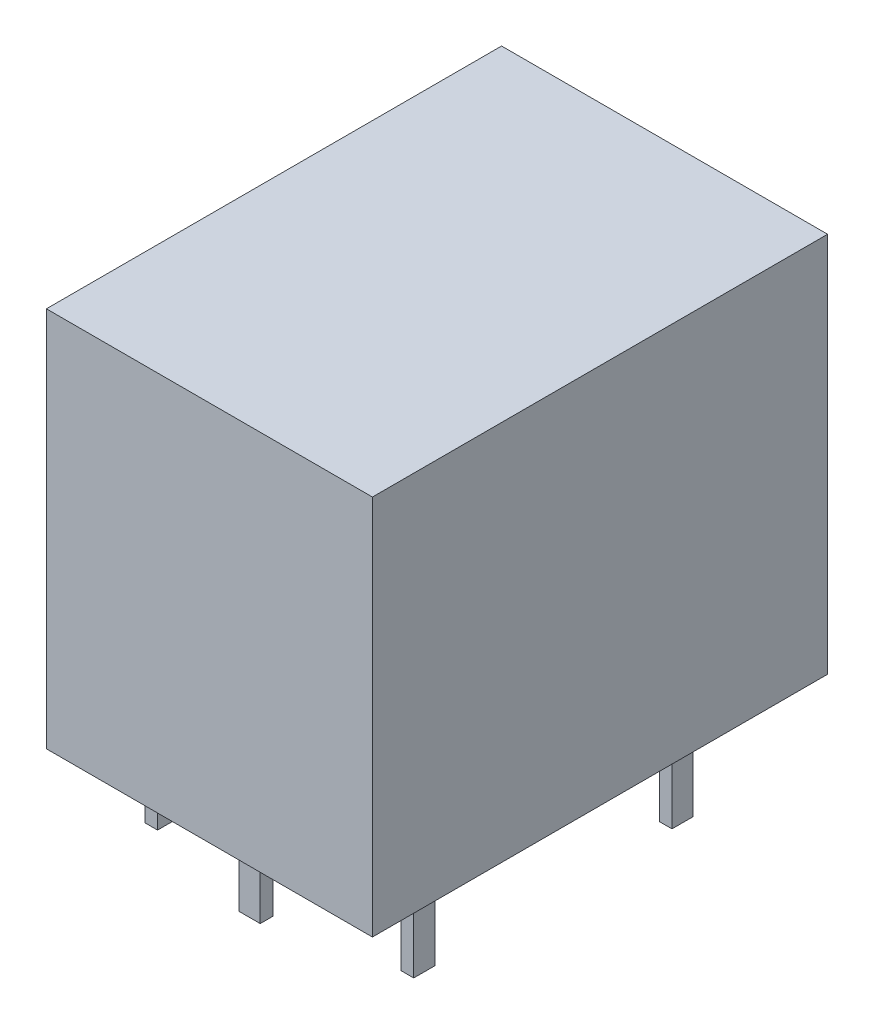
ISO-10303-21;
HEADER;
FILE_DESCRIPTION(('STEP AP214'),'2;1');
FILE_NAME('part.step','',(''),(''),'','','');
FILE_SCHEMA(('AUTOMOTIVE_DESIGN { 1 0 10303 214 1 1 1 1 }'));
ENDSEC;
DATA;
#1=APPLICATION_CONTEXT('core data for automotive mechanical design processes');
#2=APPLICATION_PROTOCOL_DEFINITION('international standard','automotive_design',2000,#1);
#3=PRODUCT_CONTEXT('',#1,'mechanical');
#4=PRODUCT('Part','Part','',(#3));
#5=PRODUCT_RELATED_PRODUCT_CATEGORY('part','',(#4));
#6=PRODUCT_DEFINITION_FORMATION('','',#4);
#7=PRODUCT_DEFINITION_CONTEXT('part definition',#1,'design');
#8=PRODUCT_DEFINITION('design','',#6,#7);
#9=PRODUCT_DEFINITION_SHAPE('','',#8);
#10=(LENGTH_UNIT() NAMED_UNIT(*) SI_UNIT(.MILLI.,.METRE.));
#11=(NAMED_UNIT(*) PLANE_ANGLE_UNIT() SI_UNIT($,.RADIAN.));
#12=(NAMED_UNIT(*) SI_UNIT($,.STERADIAN.) SOLID_ANGLE_UNIT());
#13=UNCERTAINTY_MEASURE_WITH_UNIT(LENGTH_MEASURE(1.E-05),#10,'distance_accuracy_value','');
#14=(GEOMETRIC_REPRESENTATION_CONTEXT(3) GLOBAL_UNCERTAINTY_ASSIGNED_CONTEXT((#13)) GLOBAL_UNIT_ASSIGNED_CONTEXT((#10,
#11,#12)) REPRESENTATION_CONTEXT('',''));
#15=CARTESIAN_POINT('',(0.,0.,0.));
#16=DIRECTION('',(0.,0.,1.));
#17=DIRECTION('',(1.,0.,0.));
#18=AXIS2_PLACEMENT_3D('',#15,#16,#17);
#19=CARTESIAN_POINT('',(5.75,-4.,-4.75));
#20=DIRECTION('',(1.,0.,0.));
#21=DIRECTION('',(0.,0.,-1.));
#22=AXIS2_PLACEMENT_3D('',#19,#20,#21);
#23=PLANE('',#22);
#24=DIRECTION('',(0.,0.,-1.));
#25=VECTOR('',#24,1.);
#26=CARTESIAN_POINT('',(5.75,0.,-4.75));
#27=LINE('',#26,#25);
#28=CARTESIAN_POINT('',(5.75,0.,-4.75));
#29=VERTEX_POINT('',#28);
#30=CARTESIAN_POINT('',(5.75,0.,-5.75));
#31=VERTEX_POINT('',#30);
#32=EDGE_CURVE('E109',#29,#31,#27,.T.);
#33=ORIENTED_EDGE('',*,*,#32,.T.);
#34=DIRECTION('',(0.,1.,0.));
#35=VECTOR('',#34,1.);
#36=CARTESIAN_POINT('',(5.75,-4.,-5.75));
#37=LINE('',#36,#35);
#38=CARTESIAN_POINT('',(5.75,-4.,-5.75));
#39=VERTEX_POINT('',#38);
#40=EDGE_CURVE('E12',#39,#31,#37,.T.);
#41=ORIENTED_EDGE('',*,*,#40,.F.);
#42=DIRECTION('',(0.,0.,-1.));
#43=VECTOR('',#42,1.);
#44=CARTESIAN_POINT('',(5.75,-4.,-4.75));
#45=LINE('',#44,#43);
#46=CARTESIAN_POINT('',(5.75,-4.,-4.75));
#47=VERTEX_POINT('',#46);
#48=EDGE_CURVE('E97',#47,#39,#45,.T.);
#49=ORIENTED_EDGE('',*,*,#48,.F.);
#50=DIRECTION('',(0.,1.,0.));
#51=VECTOR('',#50,1.);
#52=CARTESIAN_POINT('',(5.75,-4.,-4.75));
#53=LINE('',#52,#51);
#54=EDGE_CURVE('E105',#47,#29,#53,.T.);
#55=ORIENTED_EDGE('',*,*,#54,.T.);
#56=EDGE_LOOP('',(#33,#41,#49,#55));
#57=FACE_BOUND('',#56,.T.);
#58=ADVANCED_FACE('F46',(#57),#23,.F.);
#59=CARTESIAN_POINT('',(5.75,-4.,-5.75));
#60=DIRECTION('',(0.,0.,1.));
#61=DIRECTION('',(1.,0.,0.));
#62=AXIS2_PLACEMENT_3D('',#59,#60,#61);
#63=PLANE('',#62);
#64=DIRECTION('',(1.,0.,0.));
#65=VECTOR('',#64,1.);
#66=CARTESIAN_POINT('',(5.75,0.,-5.75));
#67=LINE('',#66,#65);
#68=CARTESIAN_POINT('',(6.35,0.,-5.75));
#69=VERTEX_POINT('',#68);
#70=EDGE_CURVE('E101',#31,#69,#67,.T.);
#71=ORIENTED_EDGE('',*,*,#70,.T.);
#72=DIRECTION('',(0.,1.,0.));
#73=VECTOR('',#72,1.);
#74=CARTESIAN_POINT('',(6.35,-4.,-5.75));
#75=LINE('',#74,#73);
#76=CARTESIAN_POINT('',(6.35,-4.,-5.75));
#77=VERTEX_POINT('',#76);
#78=EDGE_CURVE('E54',#77,#69,#75,.T.);
#79=ORIENTED_EDGE('',*,*,#78,.F.);
#80=DIRECTION('',(1.,0.,0.));
#81=VECTOR('',#80,1.);
#82=CARTESIAN_POINT('',(5.75,-4.,-5.75));
#83=LINE('',#82,#81);
#84=EDGE_CURVE('E92',#39,#77,#83,.T.);
#85=ORIENTED_EDGE('',*,*,#84,.F.);
#86=ORIENTED_EDGE('',*,*,#40,.T.);
#87=EDGE_LOOP('',(#71,#79,#85,#86));
#88=FACE_BOUND('',#87,.T.);
#89=ADVANCED_FACE('F100',(#88),#63,.F.);
#90=CARTESIAN_POINT('',(6.35,-4.,-4.75));
#91=DIRECTION('',(-1.,0.,0.));
#92=DIRECTION('',(0.,0.,1.));
#93=AXIS2_PLACEMENT_3D('',#90,#91,#92);
#94=PLANE('',#93);
#95=DIRECTION('',(0.,0.,1.));
#96=VECTOR('',#95,1.);
#97=CARTESIAN_POINT('',(6.35,0.,-4.75));
#98=LINE('',#97,#96);
#99=CARTESIAN_POINT('',(6.35,0.,-4.75));
#100=VERTEX_POINT('',#99);
#101=EDGE_CURVE('E79',#69,#100,#98,.T.);
#102=ORIENTED_EDGE('',*,*,#101,.T.);
#103=DIRECTION('',(0.,1.,0.));
#104=VECTOR('',#103,1.);
#105=CARTESIAN_POINT('',(6.35,-4.,-4.75));
#106=LINE('',#105,#104);
#107=CARTESIAN_POINT('',(6.35,-4.,-4.75));
#108=VERTEX_POINT('',#107);
#109=EDGE_CURVE('E102',#108,#100,#106,.T.);
#110=ORIENTED_EDGE('',*,*,#109,.F.);
#111=DIRECTION('',(0.,0.,1.));
#112=VECTOR('',#111,1.);
#113=CARTESIAN_POINT('',(6.35,-4.,-4.75));
#114=LINE('',#113,#112);
#115=EDGE_CURVE('E95',#77,#108,#114,.T.);
#116=ORIENTED_EDGE('',*,*,#115,.F.);
#117=ORIENTED_EDGE('',*,*,#78,.T.);
#118=EDGE_LOOP('',(#102,#110,#116,#117));
#119=FACE_BOUND('',#118,.T.);
#120=ADVANCED_FACE('F103',(#119),#94,.F.);
#121=CARTESIAN_POINT('',(5.75,-4.,-4.75));
#122=DIRECTION('',(0.,0.,-1.));
#123=DIRECTION('',(-1.,0.,0.));
#124=AXIS2_PLACEMENT_3D('',#121,#122,#123);
#125=PLANE('',#124);
#126=DIRECTION('',(-1.,0.,0.));
#127=VECTOR('',#126,1.);
#128=CARTESIAN_POINT('',(5.75,0.,-4.75));
#129=LINE('',#128,#127);
#130=EDGE_CURVE('E85',#100,#29,#129,.T.);
#131=ORIENTED_EDGE('',*,*,#130,.T.);
#132=ORIENTED_EDGE('',*,*,#54,.F.);
#133=DIRECTION('',(-1.,0.,0.));
#134=VECTOR('',#133,1.);
#135=CARTESIAN_POINT('',(5.75,-4.,-4.75));
#136=LINE('',#135,#134);
#137=EDGE_CURVE('E62',#108,#47,#136,.T.);
#138=ORIENTED_EDGE('',*,*,#137,.F.);
#139=ORIENTED_EDGE('',*,*,#109,.T.);
#140=EDGE_LOOP('',(#131,#132,#138,#139));
#141=FACE_BOUND('',#140,.T.);
#142=ADVANCED_FACE('F116',(#141),#125,.F.);
#143=CARTESIAN_POINT('',(0.,-4.,0.));
#144=DIRECTION('',(0.,-1.,0.));
#145=DIRECTION('',(0.,0.,-1.));
#146=AXIS2_PLACEMENT_3D('',#143,#144,#145);
#147=PLANE('',#146);
#148=ORIENTED_EDGE('',*,*,#48,.T.);
#149=ORIENTED_EDGE('',*,*,#84,.T.);
#150=ORIENTED_EDGE('',*,*,#115,.T.);
#151=ORIENTED_EDGE('',*,*,#137,.T.);
#152=EDGE_LOOP('',(#148,#149,#150,#151));
#153=FACE_BOUND('',#152,.T.);
#154=ADVANCED_FACE('F93',(#153),#147,.T.);
#155=CARTESIAN_POINT('',(0.,0.,0.));
#156=DIRECTION('',(0.,-1.,0.));
#157=DIRECTION('',(0.,0.,-1.));
#158=AXIS2_PLACEMENT_3D('',#155,#156,#157);
#159=PLANE('',#158);
#160=ORIENTED_EDGE('',*,*,#32,.F.);
#161=ORIENTED_EDGE('',*,*,#130,.F.);
#162=ORIENTED_EDGE('',*,*,#101,.F.);
#163=ORIENTED_EDGE('',*,*,#70,.F.);
#164=EDGE_LOOP('',(#160,#161,#162,#163));
#165=FACE_BOUND('',#164,.T.);
#166=ADVANCED_FACE('F119',(#165),#159,.F.);
#167=CLOSED_SHELL('',(#58,#89,#120,#142,#154,#166));
#168=MANIFOLD_SOLID_BREP('B2',#167);
#169=CARTESIAN_POINT('',(5.75,-4.,7.45));
#170=DIRECTION('',(1.,0.,0.));
#171=DIRECTION('',(0.,0.,-1.));
#172=AXIS2_PLACEMENT_3D('',#169,#170,#171);
#173=PLANE('',#172);
#174=DIRECTION('',(0.,0.,-1.));
#175=VECTOR('',#174,1.);
#176=CARTESIAN_POINT('',(5.75,0.,7.45));
#177=LINE('',#176,#175);
#178=CARTESIAN_POINT('',(5.75,0.,7.45));
#179=VERTEX_POINT('',#178);
#180=CARTESIAN_POINT('',(5.75,0.,6.45));
#181=VERTEX_POINT('',#180);
#182=EDGE_CURVE('E243',#179,#181,#177,.T.);
#183=ORIENTED_EDGE('',*,*,#182,.T.);
#184=DIRECTION('',(0.,1.,0.));
#185=VECTOR('',#184,1.);
#186=CARTESIAN_POINT('',(5.75,-4.,6.45));
#187=LINE('',#186,#185);
#188=CARTESIAN_POINT('',(5.75,-4.,6.45));
#189=VERTEX_POINT('',#188);
#190=EDGE_CURVE('E44',#189,#181,#187,.T.);
#191=ORIENTED_EDGE('',*,*,#190,.F.);
#192=DIRECTION('',(0.,0.,-1.));
#193=VECTOR('',#192,1.);
#194=CARTESIAN_POINT('',(5.75,-4.,7.45));
#195=LINE('',#194,#193);
#196=CARTESIAN_POINT('',(5.75,-4.,7.45));
#197=VERTEX_POINT('',#196);
#198=EDGE_CURVE('E231',#197,#189,#195,.T.);
#199=ORIENTED_EDGE('',*,*,#198,.F.);
#200=DIRECTION('',(0.,1.,0.));
#201=VECTOR('',#200,1.);
#202=CARTESIAN_POINT('',(5.75,-4.,7.45));
#203=LINE('',#202,#201);
#204=EDGE_CURVE('E239',#197,#179,#203,.T.);
#205=ORIENTED_EDGE('',*,*,#204,.T.);
#206=EDGE_LOOP('',(#183,#191,#199,#205));
#207=FACE_BOUND('',#206,.T.);
#208=ADVANCED_FACE('F180',(#207),#173,.F.);
#209=CARTESIAN_POINT('',(5.75,-4.,6.45));
#210=DIRECTION('',(0.,0.,1.));
#211=DIRECTION('',(1.,0.,0.));
#212=AXIS2_PLACEMENT_3D('',#209,#210,#211);
#213=PLANE('',#212);
#214=DIRECTION('',(1.,0.,0.));
#215=VECTOR('',#214,1.);
#216=CARTESIAN_POINT('',(5.75,0.,6.45));
#217=LINE('',#216,#215);
#218=CARTESIAN_POINT('',(6.35,0.,6.45));
#219=VERTEX_POINT('',#218);
#220=EDGE_CURVE('E235',#181,#219,#217,.T.);
#221=ORIENTED_EDGE('',*,*,#220,.T.);
#222=DIRECTION('',(0.,1.,0.));
#223=VECTOR('',#222,1.);
#224=CARTESIAN_POINT('',(6.35,-4.,6.45));
#225=LINE('',#224,#223);
#226=CARTESIAN_POINT('',(6.35,-4.,6.45));
#227=VERTEX_POINT('',#226);
#228=EDGE_CURVE('E188',#227,#219,#225,.T.);
#229=ORIENTED_EDGE('',*,*,#228,.F.);
#230=DIRECTION('',(1.,0.,0.));
#231=VECTOR('',#230,1.);
#232=CARTESIAN_POINT('',(5.75,-4.,6.45));
#233=LINE('',#232,#231);
#234=EDGE_CURVE('E226',#189,#227,#233,.T.);
#235=ORIENTED_EDGE('',*,*,#234,.F.);
#236=ORIENTED_EDGE('',*,*,#190,.T.);
#237=EDGE_LOOP('',(#221,#229,#235,#236));
#238=FACE_BOUND('',#237,.T.);
#239=ADVANCED_FACE('F234',(#238),#213,.F.);
#240=CARTESIAN_POINT('',(6.35,-4.,7.45));
#241=DIRECTION('',(-1.,0.,0.));
#242=DIRECTION('',(0.,0.,1.));
#243=AXIS2_PLACEMENT_3D('',#240,#241,#242);
#244=PLANE('',#243);
#245=DIRECTION('',(0.,0.,1.));
#246=VECTOR('',#245,1.);
#247=CARTESIAN_POINT('',(6.35,0.,7.45));
#248=LINE('',#247,#246);
#249=CARTESIAN_POINT('',(6.35,0.,7.45));
#250=VERTEX_POINT('',#249);
#251=EDGE_CURVE('E213',#219,#250,#248,.T.);
#252=ORIENTED_EDGE('',*,*,#251,.T.);
#253=DIRECTION('',(0.,1.,0.));
#254=VECTOR('',#253,1.);
#255=CARTESIAN_POINT('',(6.35,-4.,7.45));
#256=LINE('',#255,#254);
#257=CARTESIAN_POINT('',(6.35,-4.,7.45));
#258=VERTEX_POINT('',#257);
#259=EDGE_CURVE('E236',#258,#250,#256,.T.);
#260=ORIENTED_EDGE('',*,*,#259,.F.);
#261=DIRECTION('',(0.,0.,1.));
#262=VECTOR('',#261,1.);
#263=CARTESIAN_POINT('',(6.35,-4.,7.45));
#264=LINE('',#263,#262);
#265=EDGE_CURVE('E229',#227,#258,#264,.T.);
#266=ORIENTED_EDGE('',*,*,#265,.F.);
#267=ORIENTED_EDGE('',*,*,#228,.T.);
#268=EDGE_LOOP('',(#252,#260,#266,#267));
#269=FACE_BOUND('',#268,.T.);
#270=ADVANCED_FACE('F237',(#269),#244,.F.);
#271=CARTESIAN_POINT('',(5.75,-4.,7.45));
#272=DIRECTION('',(0.,0.,-1.));
#273=DIRECTION('',(-1.,0.,0.));
#274=AXIS2_PLACEMENT_3D('',#271,#272,#273);
#275=PLANE('',#274);
#276=DIRECTION('',(-1.,0.,0.));
#277=VECTOR('',#276,1.);
#278=CARTESIAN_POINT('',(5.75,0.,7.45));
#279=LINE('',#278,#277);
#280=EDGE_CURVE('E219',#250,#179,#279,.T.);
#281=ORIENTED_EDGE('',*,*,#280,.T.);
#282=ORIENTED_EDGE('',*,*,#204,.F.);
#283=DIRECTION('',(-1.,0.,0.));
#284=VECTOR('',#283,1.);
#285=CARTESIAN_POINT('',(5.75,-4.,7.45));
#286=LINE('',#285,#284);
#287=EDGE_CURVE('E196',#258,#197,#286,.T.);
#288=ORIENTED_EDGE('',*,*,#287,.F.);
#289=ORIENTED_EDGE('',*,*,#259,.T.);
#290=EDGE_LOOP('',(#281,#282,#288,#289));
#291=FACE_BOUND('',#290,.T.);
#292=ADVANCED_FACE('F250',(#291),#275,.F.);
#293=CARTESIAN_POINT('',(0.,-4.,0.));
#294=DIRECTION('',(0.,-1.,0.));
#295=DIRECTION('',(0.,0.,-1.));
#296=AXIS2_PLACEMENT_3D('',#293,#294,#295);
#297=PLANE('',#296);
#298=ORIENTED_EDGE('',*,*,#198,.T.);
#299=ORIENTED_EDGE('',*,*,#234,.T.);
#300=ORIENTED_EDGE('',*,*,#265,.T.);
#301=ORIENTED_EDGE('',*,*,#287,.T.);
#302=EDGE_LOOP('',(#298,#299,#300,#301));
#303=FACE_BOUND('',#302,.T.);
#304=ADVANCED_FACE('F227',(#303),#297,.T.);
#305=CARTESIAN_POINT('',(0.,0.,0.));
#306=DIRECTION('',(0.,-1.,0.));
#307=DIRECTION('',(0.,0.,-1.));
#308=AXIS2_PLACEMENT_3D('',#305,#306,#307);
#309=PLANE('',#308);
#310=ORIENTED_EDGE('',*,*,#182,.F.);
#311=ORIENTED_EDGE('',*,*,#280,.F.);
#312=ORIENTED_EDGE('',*,*,#251,.F.);
#313=ORIENTED_EDGE('',*,*,#220,.F.);
#314=EDGE_LOOP('',(#310,#311,#312,#313));
#315=FACE_BOUND('',#314,.T.);
#316=ADVANCED_FACE('F253',(#315),#309,.F.);
#317=CLOSED_SHELL('',(#208,#239,#270,#292,#304,#316));
#318=MANIFOLD_SOLID_BREP('B6',#317);
#319=CARTESIAN_POINT('',(-0.5,-4.,8.85));
#320=DIRECTION('',(1.,0.,0.));
#321=DIRECTION('',(0.,0.,-1.));
#322=AXIS2_PLACEMENT_3D('',#319,#320,#321);
#323=PLANE('',#322);
#324=DIRECTION('',(0.,0.,-1.));
#325=VECTOR('',#324,1.);
#326=CARTESIAN_POINT('',(-0.5,0.,8.85));
#327=LINE('',#326,#325);
#328=CARTESIAN_POINT('',(-0.5,0.,8.85));
#329=VERTEX_POINT('',#328);
#330=CARTESIAN_POINT('',(-0.5,0.,8.25));
#331=VERTEX_POINT('',#330);
#332=EDGE_CURVE('E377',#329,#331,#327,.T.);
#333=ORIENTED_EDGE('',*,*,#332,.T.);
#334=DIRECTION('',(0.,1.,0.));
#335=VECTOR('',#334,1.);
#336=CARTESIAN_POINT('',(-0.5,-4.,8.25));
#337=LINE('',#336,#335);
#338=CARTESIAN_POINT('',(-0.5,-4.,8.25));
#339=VERTEX_POINT('',#338);
#340=EDGE_CURVE('E178',#339,#331,#337,.T.);
#341=ORIENTED_EDGE('',*,*,#340,.F.);
#342=DIRECTION('',(0.,0.,-1.));
#343=VECTOR('',#342,1.);
#344=CARTESIAN_POINT('',(-0.5,-4.,8.85));
#345=LINE('',#344,#343);
#346=CARTESIAN_POINT('',(-0.5,-4.,8.85));
#347=VERTEX_POINT('',#346);
#348=EDGE_CURVE('E365',#347,#339,#345,.T.);
#349=ORIENTED_EDGE('',*,*,#348,.F.);
#350=DIRECTION('',(0.,1.,0.));
#351=VECTOR('',#350,1.);
#352=CARTESIAN_POINT('',(-0.5,-4.,8.85));
#353=LINE('',#352,#351);
#354=EDGE_CURVE('E373',#347,#329,#353,.T.);
#355=ORIENTED_EDGE('',*,*,#354,.T.);
#356=EDGE_LOOP('',(#333,#341,#349,#355));
#357=FACE_BOUND('',#356,.T.);
#358=ADVANCED_FACE('F314',(#357),#323,.F.);
#359=CARTESIAN_POINT('',(-0.5,-4.,8.25));
#360=DIRECTION('',(0.,0.,1.));
#361=DIRECTION('',(1.,0.,0.));
#362=AXIS2_PLACEMENT_3D('',#359,#360,#361);
#363=PLANE('',#362);
#364=DIRECTION('',(1.,0.,0.));
#365=VECTOR('',#364,1.);
#366=CARTESIAN_POINT('',(-0.5,0.,8.25));
#367=LINE('',#366,#365);
#368=CARTESIAN_POINT('',(0.5,0.,8.25));
#369=VERTEX_POINT('',#368);
#370=EDGE_CURVE('E369',#331,#369,#367,.T.);
#371=ORIENTED_EDGE('',*,*,#370,.T.);
#372=DIRECTION('',(0.,1.,0.));
#373=VECTOR('',#372,1.);
#374=CARTESIAN_POINT('',(0.5,-4.,8.25));
#375=LINE('',#374,#373);
#376=CARTESIAN_POINT('',(0.5,-4.,8.25));
#377=VERTEX_POINT('',#376);
#378=EDGE_CURVE('E322',#377,#369,#375,.T.);
#379=ORIENTED_EDGE('',*,*,#378,.F.);
#380=DIRECTION('',(1.,0.,0.));
#381=VECTOR('',#380,1.);
#382=CARTESIAN_POINT('',(-0.5,-4.,8.25));
#383=LINE('',#382,#381);
#384=EDGE_CURVE('E360',#339,#377,#383,.T.);
#385=ORIENTED_EDGE('',*,*,#384,.F.);
#386=ORIENTED_EDGE('',*,*,#340,.T.);
#387=EDGE_LOOP('',(#371,#379,#385,#386));
#388=FACE_BOUND('',#387,.T.);
#389=ADVANCED_FACE('F368',(#388),#363,.F.);
#390=CARTESIAN_POINT('',(0.5,-4.,8.85));
#391=DIRECTION('',(-1.,0.,0.));
#392=DIRECTION('',(0.,0.,1.));
#393=AXIS2_PLACEMENT_3D('',#390,#391,#392);
#394=PLANE('',#393);
#395=DIRECTION('',(0.,0.,1.));
#396=VECTOR('',#395,1.);
#397=CARTESIAN_POINT('',(0.5,0.,8.85));
#398=LINE('',#397,#396);
#399=CARTESIAN_POINT('',(0.5,0.,8.85));
#400=VERTEX_POINT('',#399);
#401=EDGE_CURVE('E347',#369,#400,#398,.T.);
#402=ORIENTED_EDGE('',*,*,#401,.T.);
#403=DIRECTION('',(0.,1.,0.));
#404=VECTOR('',#403,1.);
#405=CARTESIAN_POINT('',(0.5,-4.,8.85));
#406=LINE('',#405,#404);
#407=CARTESIAN_POINT('',(0.5,-4.,8.85));
#408=VERTEX_POINT('',#407);
#409=EDGE_CURVE('E370',#408,#400,#406,.T.);
#410=ORIENTED_EDGE('',*,*,#409,.F.);
#411=DIRECTION('',(0.,0.,1.));
#412=VECTOR('',#411,1.);
#413=CARTESIAN_POINT('',(0.5,-4.,8.85));
#414=LINE('',#413,#412);
#415=EDGE_CURVE('E363',#377,#408,#414,.T.);
#416=ORIENTED_EDGE('',*,*,#415,.F.);
#417=ORIENTED_EDGE('',*,*,#378,.T.);
#418=EDGE_LOOP('',(#402,#410,#416,#417));
#419=FACE_BOUND('',#418,.T.);
#420=ADVANCED_FACE('F371',(#419),#394,.F.);
#421=CARTESIAN_POINT('',(-0.5,-4.,8.85));
#422=DIRECTION('',(0.,0.,-1.));
#423=DIRECTION('',(-1.,0.,0.));
#424=AXIS2_PLACEMENT_3D('',#421,#422,#423);
#425=PLANE('',#424);
#426=DIRECTION('',(-1.,0.,0.));
#427=VECTOR('',#426,1.);
#428=CARTESIAN_POINT('',(-0.5,0.,8.85));
#429=LINE('',#428,#427);
#430=EDGE_CURVE('E353',#400,#329,#429,.T.);
#431=ORIENTED_EDGE('',*,*,#430,.T.);
#432=ORIENTED_EDGE('',*,*,#354,.F.);
#433=DIRECTION('',(-1.,0.,0.));
#434=VECTOR('',#433,1.);
#435=CARTESIAN_POINT('',(-0.5,-4.,8.85));
#436=LINE('',#435,#434);
#437=EDGE_CURVE('E330',#408,#347,#436,.T.);
#438=ORIENTED_EDGE('',*,*,#437,.F.);
#439=ORIENTED_EDGE('',*,*,#409,.T.);
#440=EDGE_LOOP('',(#431,#432,#438,#439));
#441=FACE_BOUND('',#440,.T.);
#442=ADVANCED_FACE('F384',(#441),#425,.F.);
#443=CARTESIAN_POINT('',(0.,-4.,0.));
#444=DIRECTION('',(0.,-1.,0.));
#445=DIRECTION('',(0.,0.,-1.));
#446=AXIS2_PLACEMENT_3D('',#443,#444,#445);
#447=PLANE('',#446);
#448=ORIENTED_EDGE('',*,*,#348,.T.);
#449=ORIENTED_EDGE('',*,*,#384,.T.);
#450=ORIENTED_EDGE('',*,*,#415,.T.);
#451=ORIENTED_EDGE('',*,*,#437,.T.);
#452=EDGE_LOOP('',(#448,#449,#450,#451));
#453=FACE_BOUND('',#452,.T.);
#454=ADVANCED_FACE('F361',(#453),#447,.T.);
#455=CARTESIAN_POINT('',(0.,0.,0.));
#456=DIRECTION('',(0.,-1.,0.));
#457=DIRECTION('',(0.,0.,-1.));
#458=AXIS2_PLACEMENT_3D('',#455,#456,#457);
#459=PLANE('',#458);
#460=ORIENTED_EDGE('',*,*,#332,.F.);
#461=ORIENTED_EDGE('',*,*,#430,.F.);
#462=ORIENTED_EDGE('',*,*,#401,.F.);
#463=ORIENTED_EDGE('',*,*,#370,.F.);
#464=EDGE_LOOP('',(#460,#461,#462,#463));
#465=FACE_BOUND('',#464,.T.);
#466=ADVANCED_FACE('F387',(#465),#459,.F.);
#467=CLOSED_SHELL('',(#358,#389,#420,#442,#454,#466));
#468=MANIFOLD_SOLID_BREP('B38',#467);
#469=CARTESIAN_POINT('',(-6.35,-4.,7.45));
#470=DIRECTION('',(1.,0.,0.));
#471=DIRECTION('',(0.,0.,-1.));
#472=AXIS2_PLACEMENT_3D('',#469,#470,#471);
#473=PLANE('',#472);
#474=DIRECTION('',(0.,0.,-1.));
#475=VECTOR('',#474,1.);
#476=CARTESIAN_POINT('',(-6.35,0.,7.45));
#477=LINE('',#476,#475);
#478=CARTESIAN_POINT('',(-6.35,0.,7.45));
#479=VERTEX_POINT('',#478);
#480=CARTESIAN_POINT('',(-6.35,0.,6.45));
#481=VERTEX_POINT('',#480);
#482=EDGE_CURVE('E511',#479,#481,#477,.T.);
#483=ORIENTED_EDGE('',*,*,#482,.T.);
#484=DIRECTION('',(0.,1.,0.));
#485=VECTOR('',#484,1.);
#486=CARTESIAN_POINT('',(-6.35,-4.,6.45));
#487=LINE('',#486,#485);
#488=CARTESIAN_POINT('',(-6.35,-4.,6.45));
#489=VERTEX_POINT('',#488);
#490=EDGE_CURVE('E312',#489,#481,#487,.T.);
#491=ORIENTED_EDGE('',*,*,#490,.F.);
#492=DIRECTION('',(0.,0.,-1.));
#493=VECTOR('',#492,1.);
#494=CARTESIAN_POINT('',(-6.35,-4.,7.45));
#495=LINE('',#494,#493);
#496=CARTESIAN_POINT('',(-6.35,-4.,7.45));
#497=VERTEX_POINT('',#496);
#498=EDGE_CURVE('E499',#497,#489,#495,.T.);
#499=ORIENTED_EDGE('',*,*,#498,.F.);
#500=DIRECTION('',(0.,1.,0.));
#501=VECTOR('',#500,1.);
#502=CARTESIAN_POINT('',(-6.35,-4.,7.45));
#503=LINE('',#502,#501);
#504=EDGE_CURVE('E507',#497,#479,#503,.T.);
#505=ORIENTED_EDGE('',*,*,#504,.T.);
#506=EDGE_LOOP('',(#483,#491,#499,#505));
#507=FACE_BOUND('',#506,.T.);
#508=ADVANCED_FACE('F448',(#507),#473,.F.);
#509=CARTESIAN_POINT('',(-6.35,-4.,6.45));
#510=DIRECTION('',(0.,0.,1.));
#511=DIRECTION('',(1.,0.,0.));
#512=AXIS2_PLACEMENT_3D('',#509,#510,#511);
#513=PLANE('',#512);
#514=DIRECTION('',(1.,0.,0.));
#515=VECTOR('',#514,1.);
#516=CARTESIAN_POINT('',(-6.35,0.,6.45));
#517=LINE('',#516,#515);
#518=CARTESIAN_POINT('',(-5.75,0.,6.45));
#519=VERTEX_POINT('',#518);
#520=EDGE_CURVE('E503',#481,#519,#517,.T.);
#521=ORIENTED_EDGE('',*,*,#520,.T.);
#522=DIRECTION('',(0.,1.,0.));
#523=VECTOR('',#522,1.);
#524=CARTESIAN_POINT('',(-5.75,-4.,6.45));
#525=LINE('',#524,#523);
#526=CARTESIAN_POINT('',(-5.75,-4.,6.45));
#527=VERTEX_POINT('',#526);
#528=EDGE_CURVE('E456',#527,#519,#525,.T.);
#529=ORIENTED_EDGE('',*,*,#528,.F.);
#530=DIRECTION('',(1.,0.,0.));
#531=VECTOR('',#530,1.);
#532=CARTESIAN_POINT('',(-6.35,-4.,6.45));
#533=LINE('',#532,#531);
#534=EDGE_CURVE('E494',#489,#527,#533,.T.);
#535=ORIENTED_EDGE('',*,*,#534,.F.);
#536=ORIENTED_EDGE('',*,*,#490,.T.);
#537=EDGE_LOOP('',(#521,#529,#535,#536));
#538=FACE_BOUND('',#537,.T.);
#539=ADVANCED_FACE('F502',(#538),#513,.F.);
#540=CARTESIAN_POINT('',(-5.75,-4.,7.45));
#541=DIRECTION('',(-1.,0.,0.));
#542=DIRECTION('',(0.,0.,1.));
#543=AXIS2_PLACEMENT_3D('',#540,#541,#542);
#544=PLANE('',#543);
#545=DIRECTION('',(0.,0.,1.));
#546=VECTOR('',#545,1.);
#547=CARTESIAN_POINT('',(-5.75,0.,7.45));
#548=LINE('',#547,#546);
#549=CARTESIAN_POINT('',(-5.75,0.,7.45));
#550=VERTEX_POINT('',#549);
#551=EDGE_CURVE('E481',#519,#550,#548,.T.);
#552=ORIENTED_EDGE('',*,*,#551,.T.);
#553=DIRECTION('',(0.,1.,0.));
#554=VECTOR('',#553,1.);
#555=CARTESIAN_POINT('',(-5.75,-4.,7.45));
#556=LINE('',#555,#554);
#557=CARTESIAN_POINT('',(-5.75,-4.,7.45));
#558=VERTEX_POINT('',#557);
#559=EDGE_CURVE('E504',#558,#550,#556,.T.);
#560=ORIENTED_EDGE('',*,*,#559,.F.);
#561=DIRECTION('',(0.,0.,1.));
#562=VECTOR('',#561,1.);
#563=CARTESIAN_POINT('',(-5.75,-4.,7.45));
#564=LINE('',#563,#562);
#565=EDGE_CURVE('E497',#527,#558,#564,.T.);
#566=ORIENTED_EDGE('',*,*,#565,.F.);
#567=ORIENTED_EDGE('',*,*,#528,.T.);
#568=EDGE_LOOP('',(#552,#560,#566,#567));
#569=FACE_BOUND('',#568,.T.);
#570=ADVANCED_FACE('F505',(#569),#544,.F.);
#571=CARTESIAN_POINT('',(-6.35,-4.,7.45));
#572=DIRECTION('',(0.,0.,-1.));
#573=DIRECTION('',(-1.,0.,0.));
#574=AXIS2_PLACEMENT_3D('',#571,#572,#573);
#575=PLANE('',#574);
#576=DIRECTION('',(-1.,0.,0.));
#577=VECTOR('',#576,1.);
#578=CARTESIAN_POINT('',(-6.35,0.,7.45));
#579=LINE('',#578,#577);
#580=EDGE_CURVE('E487',#550,#479,#579,.T.);
#581=ORIENTED_EDGE('',*,*,#580,.T.);
#582=ORIENTED_EDGE('',*,*,#504,.F.);
#583=DIRECTION('',(-1.,0.,0.));
#584=VECTOR('',#583,1.);
#585=CARTESIAN_POINT('',(-6.35,-4.,7.45));
#586=LINE('',#585,#584);
#587=EDGE_CURVE('E464',#558,#497,#586,.T.);
#588=ORIENTED_EDGE('',*,*,#587,.F.);
#589=ORIENTED_EDGE('',*,*,#559,.T.);
#590=EDGE_LOOP('',(#581,#582,#588,#589));
#591=FACE_BOUND('',#590,.T.);
#592=ADVANCED_FACE('F518',(#591),#575,.F.);
#593=CARTESIAN_POINT('',(0.,-4.,0.));
#594=DIRECTION('',(0.,-1.,0.));
#595=DIRECTION('',(0.,0.,-1.));
#596=AXIS2_PLACEMENT_3D('',#593,#594,#595);
#597=PLANE('',#596);
#598=ORIENTED_EDGE('',*,*,#498,.T.);
#599=ORIENTED_EDGE('',*,*,#534,.T.);
#600=ORIENTED_EDGE('',*,*,#565,.T.);
#601=ORIENTED_EDGE('',*,*,#587,.T.);
#602=EDGE_LOOP('',(#598,#599,#600,#601));
#603=FACE_BOUND('',#602,.T.);
#604=ADVANCED_FACE('F495',(#603),#597,.T.);
#605=CARTESIAN_POINT('',(0.,0.,0.));
#606=DIRECTION('',(0.,-1.,0.));
#607=DIRECTION('',(0.,0.,-1.));
#608=AXIS2_PLACEMENT_3D('',#605,#606,#607);
#609=PLANE('',#608);
#610=ORIENTED_EDGE('',*,*,#482,.F.);
#611=ORIENTED_EDGE('',*,*,#580,.F.);
#612=ORIENTED_EDGE('',*,*,#551,.F.);
#613=ORIENTED_EDGE('',*,*,#520,.F.);
#614=EDGE_LOOP('',(#610,#611,#612,#613));
#615=FACE_BOUND('',#614,.T.);
#616=ADVANCED_FACE('F521',(#615),#609,.F.);
#617=CLOSED_SHELL('',(#508,#539,#570,#592,#604,#616));
#618=MANIFOLD_SOLID_BREP('B172',#617);
#619=CARTESIAN_POINT('',(-6.35,-4.,-4.75));
#620=DIRECTION('',(1.,0.,0.));
#621=DIRECTION('',(0.,0.,-1.));
#622=AXIS2_PLACEMENT_3D('',#619,#620,#621);
#623=PLANE('',#622);
#624=DIRECTION('',(0.,0.,-1.));
#625=VECTOR('',#624,1.);
#626=CARTESIAN_POINT('',(-6.35,0.,-4.75));
#627=LINE('',#626,#625);
#628=CARTESIAN_POINT('',(-6.35,0.,-4.75));
#629=VERTEX_POINT('',#628);
#630=CARTESIAN_POINT('',(-6.35,0.,-5.75));
#631=VERTEX_POINT('',#630);
#632=EDGE_CURVE('E644',#629,#631,#627,.T.);
#633=ORIENTED_EDGE('',*,*,#632,.T.);
#634=DIRECTION('',(0.,1.,0.));
#635=VECTOR('',#634,1.);
#636=CARTESIAN_POINT('',(-6.35,-4.,-5.75));
#637=LINE('',#636,#635);
#638=CARTESIAN_POINT('',(-6.35,-4.,-5.75));
#639=VERTEX_POINT('',#638);
#640=EDGE_CURVE('E446',#639,#631,#637,.T.);
#641=ORIENTED_EDGE('',*,*,#640,.F.);
#642=DIRECTION('',(0.,0.,-1.));
#643=VECTOR('',#642,1.);
#644=CARTESIAN_POINT('',(-6.35,-4.,-4.75));
#645=LINE('',#644,#643);
#646=CARTESIAN_POINT('',(-6.35,-4.,-4.75));
#647=VERTEX_POINT('',#646);
#648=EDGE_CURVE('E632',#647,#639,#645,.T.);
#649=ORIENTED_EDGE('',*,*,#648,.F.);
#650=DIRECTION('',(0.,1.,0.));
#651=VECTOR('',#650,1.);
#652=CARTESIAN_POINT('',(-6.35,-4.,-4.75));
#653=LINE('',#652,#651);
#654=EDGE_CURVE('E640',#647,#629,#653,.T.);
#655=ORIENTED_EDGE('',*,*,#654,.T.);
#656=EDGE_LOOP('',(#633,#641,#649,#655));
#657=FACE_BOUND('',#656,.T.);
#658=ADVANCED_FACE('F581',(#657),#623,.F.);
#659=CARTESIAN_POINT('',(-6.35,-4.,-5.75));
#660=DIRECTION('',(0.,0.,1.));
#661=DIRECTION('',(1.,0.,0.));
#662=AXIS2_PLACEMENT_3D('',#659,#660,#661);
#663=PLANE('',#662);
#664=DIRECTION('',(1.,0.,0.));
#665=VECTOR('',#664,1.);
#666=CARTESIAN_POINT('',(-6.35,0.,-5.75));
#667=LINE('',#666,#665);
#668=CARTESIAN_POINT('',(-5.75,0.,-5.75));
#669=VERTEX_POINT('',#668);
#670=EDGE_CURVE('E636',#631,#669,#667,.T.);
#671=ORIENTED_EDGE('',*,*,#670,.T.);
#672=DIRECTION('',(0.,1.,0.));
#673=VECTOR('',#672,1.);
#674=CARTESIAN_POINT('',(-5.75,-4.,-5.75));
#675=LINE('',#674,#673);
#676=CARTESIAN_POINT('',(-5.75,-4.,-5.75));
#677=VERTEX_POINT('',#676);
#678=EDGE_CURVE('E589',#677,#669,#675,.T.);
#679=ORIENTED_EDGE('',*,*,#678,.F.);
#680=DIRECTION('',(1.,0.,0.));
#681=VECTOR('',#680,1.);
#682=CARTESIAN_POINT('',(-6.35,-4.,-5.75));
#683=LINE('',#682,#681);
#684=EDGE_CURVE('E627',#639,#677,#683,.T.);
#685=ORIENTED_EDGE('',*,*,#684,.F.);
#686=ORIENTED_EDGE('',*,*,#640,.T.);
#687=EDGE_LOOP('',(#671,#679,#685,#686));
#688=FACE_BOUND('',#687,.T.);
#689=ADVANCED_FACE('F635',(#688),#663,.F.);
#690=CARTESIAN_POINT('',(-5.75,-4.,-4.75));
#691=DIRECTION('',(-1.,0.,0.));
#692=DIRECTION('',(0.,0.,1.));
#693=AXIS2_PLACEMENT_3D('',#690,#691,#692);
#694=PLANE('',#693);
#695=DIRECTION('',(0.,0.,1.));
#696=VECTOR('',#695,1.);
#697=CARTESIAN_POINT('',(-5.75,0.,-4.75));
#698=LINE('',#697,#696);
#699=CARTESIAN_POINT('',(-5.75,0.,-4.75));
#700=VERTEX_POINT('',#699);
#701=EDGE_CURVE('E614',#669,#700,#698,.T.);
#702=ORIENTED_EDGE('',*,*,#701,.T.);
#703=DIRECTION('',(0.,1.,0.));
#704=VECTOR('',#703,1.);
#705=CARTESIAN_POINT('',(-5.75,-4.,-4.75));
#706=LINE('',#705,#704);
#707=CARTESIAN_POINT('',(-5.75,-4.,-4.75));
#708=VERTEX_POINT('',#707);
#709=EDGE_CURVE('E637',#708,#700,#706,.T.);
#710=ORIENTED_EDGE('',*,*,#709,.F.);
#711=DIRECTION('',(0.,0.,1.));
#712=VECTOR('',#711,1.);
#713=CARTESIAN_POINT('',(-5.75,-4.,-4.75));
#714=LINE('',#713,#712);
#715=EDGE_CURVE('E630',#677,#708,#714,.T.);
#716=ORIENTED_EDGE('',*,*,#715,.F.);
#717=ORIENTED_EDGE('',*,*,#678,.T.);
#718=EDGE_LOOP('',(#702,#710,#716,#717));
#719=FACE_BOUND('',#718,.T.);
#720=ADVANCED_FACE('F638',(#719),#694,.F.);
#721=CARTESIAN_POINT('',(-6.35,-4.,-4.75));
#722=DIRECTION('',(0.,0.,-1.));
#723=DIRECTION('',(-1.,0.,0.));
#724=AXIS2_PLACEMENT_3D('',#721,#722,#723);
#725=PLANE('',#724);
#726=DIRECTION('',(-1.,0.,0.));
#727=VECTOR('',#726,1.);
#728=CARTESIAN_POINT('',(-6.35,0.,-4.75));
#729=LINE('',#728,#727);
#730=EDGE_CURVE('E620',#700,#629,#729,.T.);
#731=ORIENTED_EDGE('',*,*,#730,.T.);
#732=ORIENTED_EDGE('',*,*,#654,.F.);
#733=DIRECTION('',(-1.,0.,0.));
#734=VECTOR('',#733,1.);
#735=CARTESIAN_POINT('',(-6.35,-4.,-4.75));
#736=LINE('',#735,#734);
#737=EDGE_CURVE('E597',#708,#647,#736,.T.);
#738=ORIENTED_EDGE('',*,*,#737,.F.);
#739=ORIENTED_EDGE('',*,*,#709,.T.);
#740=EDGE_LOOP('',(#731,#732,#738,#739));
#741=FACE_BOUND('',#740,.T.);
#742=ADVANCED_FACE('F651',(#741),#725,.F.);
#743=CARTESIAN_POINT('',(0.,-4.,0.));
#744=DIRECTION('',(0.,-1.,0.));
#745=DIRECTION('',(0.,0.,-1.));
#746=AXIS2_PLACEMENT_3D('',#743,#744,#745);
#747=PLANE('',#746);
#748=ORIENTED_EDGE('',*,*,#648,.T.);
#749=ORIENTED_EDGE('',*,*,#684,.T.);
#750=ORIENTED_EDGE('',*,*,#715,.T.);
#751=ORIENTED_EDGE('',*,*,#737,.T.);
#752=EDGE_LOOP('',(#748,#749,#750,#751));
#753=FACE_BOUND('',#752,.T.);
#754=ADVANCED_FACE('F628',(#753),#747,.T.);
#755=CARTESIAN_POINT('',(0.,0.,0.));
#756=DIRECTION('',(0.,-1.,0.));
#757=DIRECTION('',(0.,0.,-1.));
#758=AXIS2_PLACEMENT_3D('',#755,#756,#757);
#759=PLANE('',#758);
#760=ORIENTED_EDGE('',*,*,#632,.F.);
#761=ORIENTED_EDGE('',*,*,#730,.F.);
#762=ORIENTED_EDGE('',*,*,#701,.F.);
#763=ORIENTED_EDGE('',*,*,#670,.F.);
#764=EDGE_LOOP('',(#760,#761,#762,#763));
#765=FACE_BOUND('',#764,.T.);
#766=ADVANCED_FACE('F654',(#765),#759,.F.);
#767=CLOSED_SHELL('',(#658,#689,#720,#742,#754,#766));
#768=MANIFOLD_SOLID_BREP('B306',#767);
#769=CARTESIAN_POINT('',(7.7,18.,-10.75));
#770=DIRECTION('',(-1.,0.,0.));
#771=DIRECTION('',(0.,0.,1.));
#772=AXIS2_PLACEMENT_3D('',#769,#770,#771);
#773=PLANE('',#772);
#774=DIRECTION('',(0.,0.,-1.));
#775=VECTOR('',#774,1.);
#776=CARTESIAN_POINT('',(7.7,0.,-10.75));
#777=LINE('',#776,#775);
#778=CARTESIAN_POINT('',(7.7,0.,10.75));
#779=VERTEX_POINT('',#778);
#780=CARTESIAN_POINT('',(7.7,0.,-10.75));
#781=VERTEX_POINT('',#780);
#782=EDGE_CURVE('E768',#779,#781,#777,.T.);
#783=ORIENTED_EDGE('',*,*,#782,.T.);
#784=DIRECTION('',(0.,-1.,0.));
#785=VECTOR('',#784,1.);
#786=CARTESIAN_POINT('',(7.7,18.,-10.75));
#787=LINE('',#786,#785);
#788=CARTESIAN_POINT('',(7.7,18.,-10.75));
#789=VERTEX_POINT('',#788);
#790=EDGE_CURVE('E579',#789,#781,#787,.T.);
#791=ORIENTED_EDGE('',*,*,#790,.F.);
#792=DIRECTION('',(0.,0.,-1.));
#793=VECTOR('',#792,1.);
#794=CARTESIAN_POINT('',(7.7,18.,-10.75));
#795=LINE('',#794,#793);
#796=CARTESIAN_POINT('',(7.7,18.,10.75));
#797=VERTEX_POINT('',#796);
#798=EDGE_CURVE('E756',#797,#789,#795,.T.);
#799=ORIENTED_EDGE('',*,*,#798,.F.);
#800=DIRECTION('',(0.,-1.,0.));
#801=VECTOR('',#800,1.);
#802=CARTESIAN_POINT('',(7.7,18.,10.75));
#803=LINE('',#802,#801);
#804=EDGE_CURVE('E764',#797,#779,#803,.T.);
#805=ORIENTED_EDGE('',*,*,#804,.T.);
#806=EDGE_LOOP('',(#783,#791,#799,#805));
#807=FACE_BOUND('',#806,.T.);
#808=ADVANCED_FACE('F705',(#807),#773,.F.);
#809=CARTESIAN_POINT('',(-7.7,18.,-10.75));
#810=DIRECTION('',(0.,0.,1.));
#811=DIRECTION('',(1.,0.,0.));
#812=AXIS2_PLACEMENT_3D('',#809,#810,#811);
#813=PLANE('',#812);
#814=DIRECTION('',(-1.,0.,0.));
#815=VECTOR('',#814,1.);
#816=CARTESIAN_POINT('',(-7.7,0.,-10.75));
#817=LINE('',#816,#815);
#818=CARTESIAN_POINT('',(-7.7,0.,-10.75));
#819=VERTEX_POINT('',#818);
#820=EDGE_CURVE('E760',#781,#819,#817,.T.);
#821=ORIENTED_EDGE('',*,*,#820,.T.);
#822=DIRECTION('',(0.,-1.,0.));
#823=VECTOR('',#822,1.);
#824=CARTESIAN_POINT('',(-7.7,18.,-10.75));
#825=LINE('',#824,#823);
#826=CARTESIAN_POINT('',(-7.7,18.,-10.75));
#827=VERTEX_POINT('',#826);
#828=EDGE_CURVE('E713',#827,#819,#825,.T.);
#829=ORIENTED_EDGE('',*,*,#828,.F.);
#830=DIRECTION('',(-1.,0.,0.));
#831=VECTOR('',#830,1.);
#832=CARTESIAN_POINT('',(-7.7,18.,-10.75));
#833=LINE('',#832,#831);
#834=EDGE_CURVE('E751',#789,#827,#833,.T.);
#835=ORIENTED_EDGE('',*,*,#834,.F.);
#836=ORIENTED_EDGE('',*,*,#790,.T.);
#837=EDGE_LOOP('',(#821,#829,#835,#836));
#838=FACE_BOUND('',#837,.T.);
#839=ADVANCED_FACE('F759',(#838),#813,.F.);
#840=CARTESIAN_POINT('',(-7.7,18.,-10.75));
#841=DIRECTION('',(1.,0.,0.));
#842=DIRECTION('',(0.,0.,-1.));
#843=AXIS2_PLACEMENT_3D('',#840,#841,#842);
#844=PLANE('',#843);
#845=DIRECTION('',(0.,0.,1.));
#846=VECTOR('',#845,1.);
#847=CARTESIAN_POINT('',(-7.7,0.,-10.75));
#848=LINE('',#847,#846);
#849=CARTESIAN_POINT('',(-7.7,0.,10.75));
#850=VERTEX_POINT('',#849);
#851=EDGE_CURVE('E738',#819,#850,#848,.T.);
#852=ORIENTED_EDGE('',*,*,#851,.T.);
#853=DIRECTION('',(0.,-1.,0.));
#854=VECTOR('',#853,1.);
#855=CARTESIAN_POINT('',(-7.7,18.,10.75));
#856=LINE('',#855,#854);
#857=CARTESIAN_POINT('',(-7.7,18.,10.75));
#858=VERTEX_POINT('',#857);
#859=EDGE_CURVE('E761',#858,#850,#856,.T.);
#860=ORIENTED_EDGE('',*,*,#859,.F.);
#861=DIRECTION('',(0.,0.,1.));
#862=VECTOR('',#861,1.);
#863=CARTESIAN_POINT('',(-7.7,18.,-10.75));
#864=LINE('',#863,#862);
#865=EDGE_CURVE('E754',#827,#858,#864,.T.);
#866=ORIENTED_EDGE('',*,*,#865,.F.);
#867=ORIENTED_EDGE('',*,*,#828,.T.);
#868=EDGE_LOOP('',(#852,#860,#866,#867));
#869=FACE_BOUND('',#868,.T.);
#870=ADVANCED_FACE('F762',(#869),#844,.F.);
#871=CARTESIAN_POINT('',(-7.7,18.,10.75));
#872=DIRECTION('',(0.,0.,-1.));
#873=DIRECTION('',(-1.,0.,0.));
#874=AXIS2_PLACEMENT_3D('',#871,#872,#873);
#875=PLANE('',#874);
#876=DIRECTION('',(1.,0.,0.));
#877=VECTOR('',#876,1.);
#878=CARTESIAN_POINT('',(-7.7,0.,10.75));
#879=LINE('',#878,#877);
#880=EDGE_CURVE('E744',#850,#779,#879,.T.);
#881=ORIENTED_EDGE('',*,*,#880,.T.);
#882=ORIENTED_EDGE('',*,*,#804,.F.);
#883=DIRECTION('',(1.,0.,0.));
#884=VECTOR('',#883,1.);
#885=CARTESIAN_POINT('',(-7.7,18.,10.75));
#886=LINE('',#885,#884);
#887=EDGE_CURVE('E721',#858,#797,#886,.T.);
#888=ORIENTED_EDGE('',*,*,#887,.F.);
#889=ORIENTED_EDGE('',*,*,#859,.T.);
#890=EDGE_LOOP('',(#881,#882,#888,#889));
#891=FACE_BOUND('',#890,.T.);
#892=ADVANCED_FACE('F775',(#891),#875,.F.);
#893=CARTESIAN_POINT('',(0.,18.,0.));
#894=DIRECTION('',(0.,1.,0.));
#895=DIRECTION('',(0.,0.,1.));
#896=AXIS2_PLACEMENT_3D('',#893,#894,#895);
#897=PLANE('',#896);
#898=ORIENTED_EDGE('',*,*,#798,.T.);
#899=ORIENTED_EDGE('',*,*,#834,.T.);
#900=ORIENTED_EDGE('',*,*,#865,.T.);
#901=ORIENTED_EDGE('',*,*,#887,.T.);
#902=EDGE_LOOP('',(#898,#899,#900,#901));
#903=FACE_BOUND('',#902,.T.);
#904=ADVANCED_FACE('F752',(#903),#897,.T.);
#905=CARTESIAN_POINT('',(0.,0.,0.));
#906=DIRECTION('',(0.,1.,0.));
#907=DIRECTION('',(0.,0.,1.));
#908=AXIS2_PLACEMENT_3D('',#905,#906,#907);
#909=PLANE('',#908);
#910=ORIENTED_EDGE('',*,*,#782,.F.);
#911=ORIENTED_EDGE('',*,*,#880,.F.);
#912=ORIENTED_EDGE('',*,*,#851,.F.);
#913=ORIENTED_EDGE('',*,*,#820,.F.);
#914=EDGE_LOOP('',(#910,#911,#912,#913));
#915=FACE_BOUND('',#914,.T.);
#916=ADVANCED_FACE('F778',(#915),#909,.F.);
#917=CLOSED_SHELL('',(#808,#839,#870,#892,#904,#916));
#918=MANIFOLD_SOLID_BREP('B440',#917);
#919=ADVANCED_BREP_SHAPE_REPRESENTATION('',(#18,#168,#318,#468,#618,#768,#918),#14);
#920=SHAPE_DEFINITION_REPRESENTATION(#9,#919);
ENDSEC;
END-ISO-10303-21;
